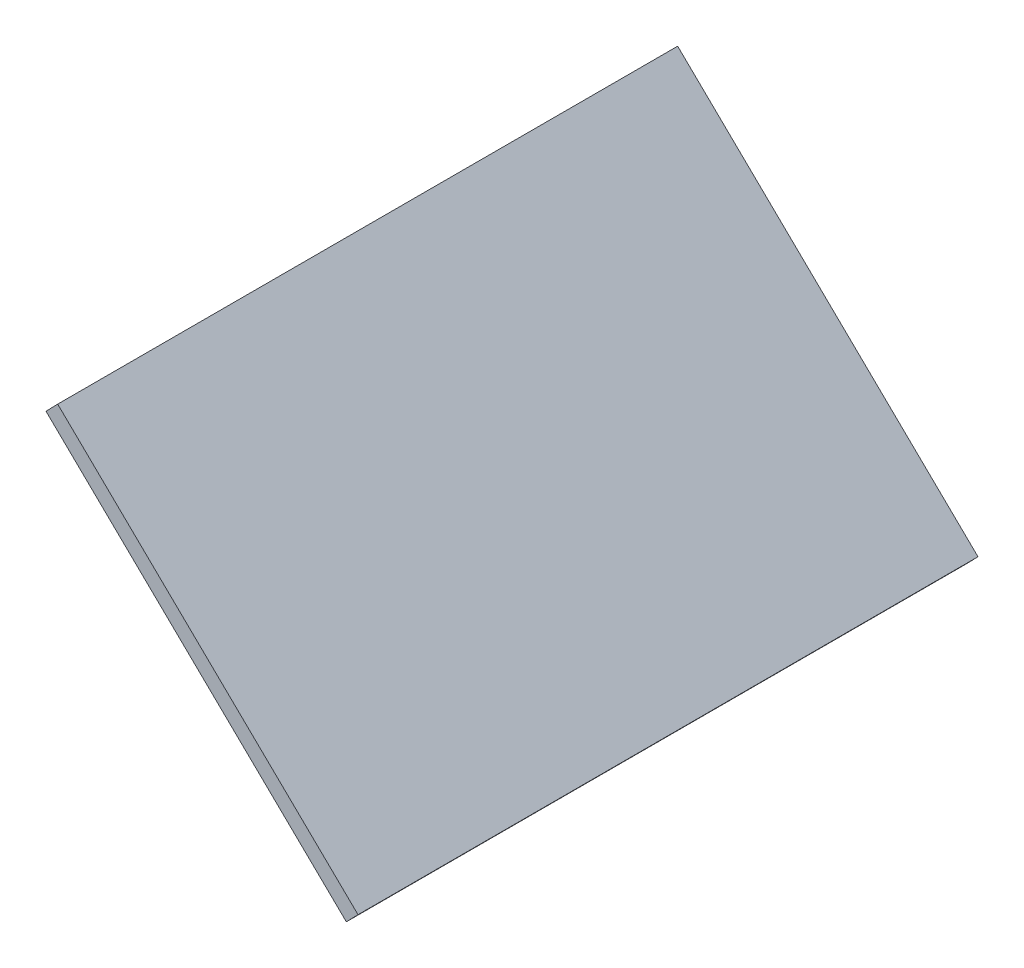
ISO-10303-21;
HEADER;
FILE_DESCRIPTION(('STEP AP214'),'2;1');
FILE_NAME('part.step','',(''),(''),'','','');
FILE_SCHEMA(('AUTOMOTIVE_DESIGN { 1 0 10303 214 1 1 1 1 }'));
ENDSEC;
DATA;
#1=APPLICATION_CONTEXT('core data for automotive mechanical design processes');
#2=APPLICATION_PROTOCOL_DEFINITION('international standard','automotive_design',2000,#1);
#3=PRODUCT_CONTEXT('',#1,'mechanical');
#4=PRODUCT('Part','Part','',(#3));
#5=PRODUCT_RELATED_PRODUCT_CATEGORY('part','',(#4));
#6=PRODUCT_DEFINITION_FORMATION('','',#4);
#7=PRODUCT_DEFINITION_CONTEXT('part definition',#1,'design');
#8=PRODUCT_DEFINITION('design','',#6,#7);
#9=PRODUCT_DEFINITION_SHAPE('','',#8);
#10=(LENGTH_UNIT() NAMED_UNIT(*) SI_UNIT(.MILLI.,.METRE.));
#11=(NAMED_UNIT(*) PLANE_ANGLE_UNIT() SI_UNIT($,.RADIAN.));
#12=(NAMED_UNIT(*) SI_UNIT($,.STERADIAN.) SOLID_ANGLE_UNIT());
#13=UNCERTAINTY_MEASURE_WITH_UNIT(LENGTH_MEASURE(1.E-05),#10,'distance_accuracy_value','');
#14=(GEOMETRIC_REPRESENTATION_CONTEXT(3) GLOBAL_UNCERTAINTY_ASSIGNED_CONTEXT((#13)) GLOBAL_UNIT_ASSIGNED_CONTEXT((#10,
#11,#12)) REPRESENTATION_CONTEXT('',''));
#15=CARTESIAN_POINT('',(0.,0.,0.));
#16=DIRECTION('',(0.,0.,1.));
#17=DIRECTION('',(1.,0.,0.));
#18=AXIS2_PLACEMENT_3D('',#15,#16,#17);
#19=CARTESIAN_POINT('',(-3.39415678658355,132.566010162371,-37.0000000000001));
#20=DIRECTION('',(-0.71699491881443,0.697078393291808,0.));
#21=DIRECTION('',(-0.697078393291808,-0.71699491881443,0.));
#22=AXIS2_PLACEMENT_3D('',#19,#20,#21);
#23=PLANE('',#22);
#24=DIRECTION('',(0.,0.,1.));
#25=VECTOR('',#24,1.);
#26=CARTESIAN_POINT('',(-1.99999999999993,134.,-37.0000000000001));
#27=LINE('',#26,#25);
#28=CARTESIAN_POINT('',(-1.99999999999993,134.,-37.0000000000001));
#29=VERTEX_POINT('',#28);
#30=CARTESIAN_POINT('',(-1.99999999999995,134.,36.9999999999999));
#31=VERTEX_POINT('',#30);
#32=EDGE_CURVE('E99',#29,#31,#27,.T.);
#33=ORIENTED_EDGE('',*,*,#32,.T.);
#34=DIRECTION('',(0.697078393291808,0.71699491881443,0.));
#35=VECTOR('',#34,1.);
#36=CARTESIAN_POINT('',(-3.39415678658356,132.566010162371,36.9999999999999));
#37=LINE('',#36,#35);
#38=CARTESIAN_POINT('',(-3.39415678658356,132.566010162371,36.9999999999999));
#39=VERTEX_POINT('',#38);
#40=EDGE_CURVE('E11',#39,#31,#37,.T.);
#41=ORIENTED_EDGE('',*,*,#40,.F.);
#42=DIRECTION('',(0.,0.,1.));
#43=VECTOR('',#42,1.);
#44=CARTESIAN_POINT('',(-3.39415678658355,132.566010162371,-37.0000000000001));
#45=LINE('',#44,#43);
#46=CARTESIAN_POINT('',(-3.39415678658355,132.566010162371,-37.0000000000001));
#47=VERTEX_POINT('',#46);
#48=EDGE_CURVE('E87',#47,#39,#45,.T.);
#49=ORIENTED_EDGE('',*,*,#48,.F.);
#50=DIRECTION('',(0.697078393291808,0.71699491881443,0.));
#51=VECTOR('',#50,1.);
#52=CARTESIAN_POINT('',(-3.39415678658355,132.566010162371,-37.0000000000001));
#53=LINE('',#52,#51);
#54=EDGE_CURVE('E95',#47,#29,#53,.T.);
#55=ORIENTED_EDGE('',*,*,#54,.T.);
#56=EDGE_LOOP('',(#33,#41,#49,#55));
#57=FACE_BOUND('',#56,.T.);
#58=ADVANCED_FACE('F36',(#57),#23,.F.);
#59=CARTESIAN_POINT('',(-3.39415678658356,132.566010162371,36.9999999999999));
#60=DIRECTION('',(0.,0.,-1.));
#61=DIRECTION('',(-1.,0.,0.));
#62=AXIS2_PLACEMENT_3D('',#59,#60,#61);
#63=PLANE('',#62);
#64=DIRECTION('',(-0.71699491881443,0.697078393291808,0.));
#65=VECTOR('',#64,1.);
#66=CARTESIAN_POINT('',(-1.99999999999995,134.,36.9999999999999));
#67=LINE('',#66,#65);
#68=CARTESIAN_POINT('',(-37.8497459407214,168.853919664591,36.9999999999999));
#69=VERTEX_POINT('',#68);
#70=EDGE_CURVE('E91',#31,#69,#67,.T.);
#71=ORIENTED_EDGE('',*,*,#70,.T.);
#72=DIRECTION('',(0.697078393291808,0.71699491881443,0.));
#73=VECTOR('',#72,1.);
#74=CARTESIAN_POINT('',(-39.2439027273051,167.419929826962,36.9999999999999));
#75=LINE('',#74,#73);
#76=CARTESIAN_POINT('',(-39.2439027273051,167.419929826962,36.9999999999999));
#77=VERTEX_POINT('',#76);
#78=EDGE_CURVE('E44',#77,#69,#75,.T.);
#79=ORIENTED_EDGE('',*,*,#78,.F.);
#80=DIRECTION('',(-0.71699491881443,0.697078393291808,0.));
#81=VECTOR('',#80,1.);
#82=CARTESIAN_POINT('',(-3.39415678658356,132.566010162371,36.9999999999999));
#83=LINE('',#82,#81);
#84=EDGE_CURVE('E82',#39,#77,#83,.T.);
#85=ORIENTED_EDGE('',*,*,#84,.F.);
#86=ORIENTED_EDGE('',*,*,#40,.T.);
#87=EDGE_LOOP('',(#71,#79,#85,#86));
#88=FACE_BOUND('',#87,.T.);
#89=ADVANCED_FACE('F90',(#88),#63,.F.);
#90=CARTESIAN_POINT('',(-39.243902727305,167.419929826962,-37.0000000000001));
#91=DIRECTION('',(0.71699491881443,-0.697078393291808,0.));
#92=DIRECTION('',(0.697078393291808,0.71699491881443,0.));
#93=AXIS2_PLACEMENT_3D('',#90,#91,#92);
#94=PLANE('',#93);
#95=DIRECTION('',(0.,0.,-1.));
#96=VECTOR('',#95,1.);
#97=CARTESIAN_POINT('',(-37.8497459407214,168.853919664591,-37.0000000000001));
#98=LINE('',#97,#96);
#99=CARTESIAN_POINT('',(-37.8497459407214,168.853919664591,-37.0000000000001));
#100=VERTEX_POINT('',#99);
#101=EDGE_CURVE('E69',#69,#100,#98,.T.);
#102=ORIENTED_EDGE('',*,*,#101,.T.);
#103=DIRECTION('',(0.697078393291808,0.71699491881443,0.));
#104=VECTOR('',#103,1.);
#105=CARTESIAN_POINT('',(-39.243902727305,167.419929826962,-37.0000000000001));
#106=LINE('',#105,#104);
#107=CARTESIAN_POINT('',(-39.243902727305,167.419929826962,-37.0000000000001));
#108=VERTEX_POINT('',#107);
#109=EDGE_CURVE('E92',#108,#100,#106,.T.);
#110=ORIENTED_EDGE('',*,*,#109,.F.);
#111=DIRECTION('',(0.,0.,-1.));
#112=VECTOR('',#111,1.);
#113=CARTESIAN_POINT('',(-39.243902727305,167.419929826962,-37.0000000000001));
#114=LINE('',#113,#112);
#115=EDGE_CURVE('E85',#77,#108,#114,.T.);
#116=ORIENTED_EDGE('',*,*,#115,.F.);
#117=ORIENTED_EDGE('',*,*,#78,.T.);
#118=EDGE_LOOP('',(#102,#110,#116,#117));
#119=FACE_BOUND('',#118,.T.);
#120=ADVANCED_FACE('F93',(#119),#94,.F.);
#121=CARTESIAN_POINT('',(-3.39415678658355,132.566010162371,-37.0000000000001));
#122=DIRECTION('',(0.,0.,1.));
#123=DIRECTION('',(1.,0.,0.));
#124=AXIS2_PLACEMENT_3D('',#121,#122,#123);
#125=PLANE('',#124);
#126=DIRECTION('',(0.71699491881443,-0.697078393291808,0.));
#127=VECTOR('',#126,1.);
#128=CARTESIAN_POINT('',(-1.99999999999993,134.,-37.0000000000001));
#129=LINE('',#128,#127);
#130=EDGE_CURVE('E75',#100,#29,#129,.T.);
#131=ORIENTED_EDGE('',*,*,#130,.T.);
#132=ORIENTED_EDGE('',*,*,#54,.F.);
#133=DIRECTION('',(0.71699491881443,-0.697078393291808,0.));
#134=VECTOR('',#133,1.);
#135=CARTESIAN_POINT('',(-3.39415678658355,132.566010162371,-37.0000000000001));
#136=LINE('',#135,#134);
#137=EDGE_CURVE('E52',#108,#47,#136,.T.);
#138=ORIENTED_EDGE('',*,*,#137,.F.);
#139=ORIENTED_EDGE('',*,*,#109,.T.);
#140=EDGE_LOOP('',(#131,#132,#138,#139));
#141=FACE_BOUND('',#140,.T.);
#142=ADVANCED_FACE('F106',(#141),#125,.F.);
#143=CARTESIAN_POINT('',(64.6074298853721,66.4533564535254,0.));
#144=DIRECTION('',(-0.697078393291808,-0.71699491881443,0.));
#145=DIRECTION('',(0.71699491881443,-0.697078393291808,0.));
#146=AXIS2_PLACEMENT_3D('',#143,#144,#145);
#147=PLANE('',#146);
#148=ORIENTED_EDGE('',*,*,#48,.T.);
#149=ORIENTED_EDGE('',*,*,#84,.T.);
#150=ORIENTED_EDGE('',*,*,#115,.T.);
#151=ORIENTED_EDGE('',*,*,#137,.T.);
#152=EDGE_LOOP('',(#148,#149,#150,#151));
#153=FACE_BOUND('',#152,.T.);
#154=ADVANCED_FACE('F83',(#153),#147,.T.);
#155=CARTESIAN_POINT('',(66.0015866719557,67.8873462911543,0.));
#156=DIRECTION('',(-0.697078393291808,-0.71699491881443,0.));
#157=DIRECTION('',(0.71699491881443,-0.697078393291808,0.));
#158=AXIS2_PLACEMENT_3D('',#155,#156,#157);
#159=PLANE('',#158);
#160=ORIENTED_EDGE('',*,*,#32,.F.);
#161=ORIENTED_EDGE('',*,*,#130,.F.);
#162=ORIENTED_EDGE('',*,*,#101,.F.);
#163=ORIENTED_EDGE('',*,*,#70,.F.);
#164=EDGE_LOOP('',(#160,#161,#162,#163));
#165=FACE_BOUND('',#164,.T.);
#166=ADVANCED_FACE('F109',(#165),#159,.F.);
#167=CLOSED_SHELL('',(#58,#89,#120,#142,#154,#166));
#168=MANIFOLD_SOLID_BREP('B2',#167);
#169=ADVANCED_BREP_SHAPE_REPRESENTATION('',(#18,#168),#14);
#170=SHAPE_DEFINITION_REPRESENTATION(#9,#169);
ENDSEC;
END-ISO-10303-21;
